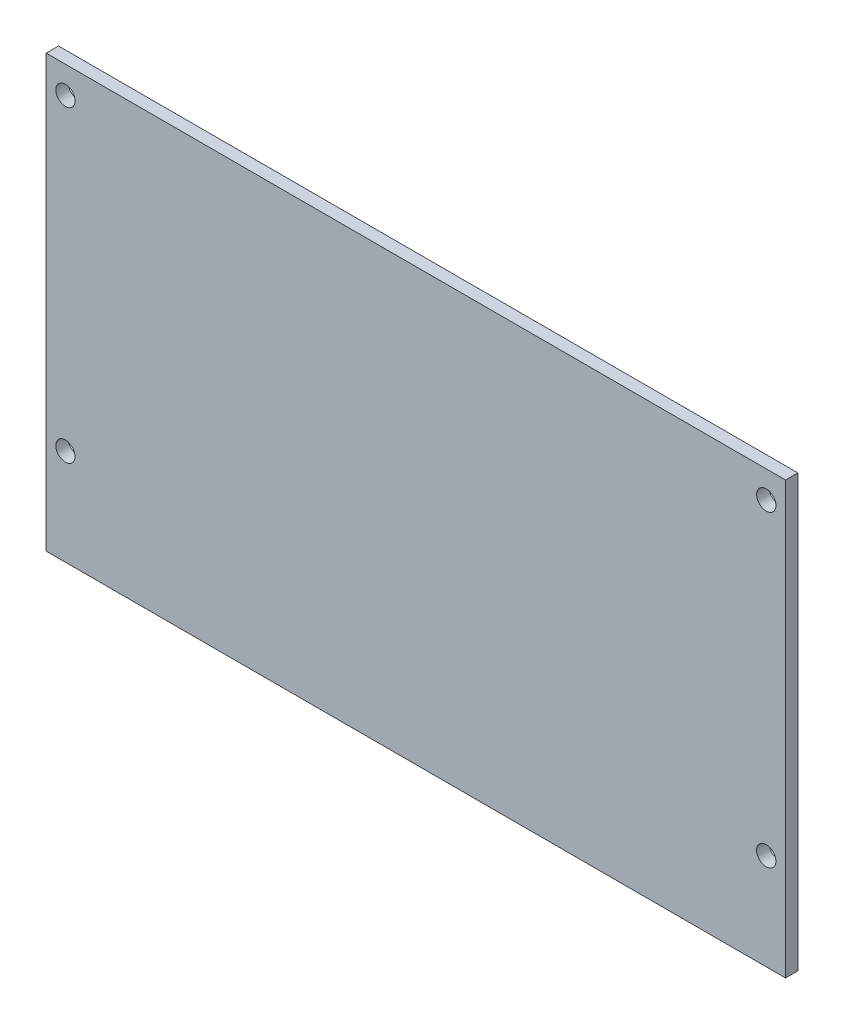
ISO-10303-21;
HEADER;
FILE_DESCRIPTION(('STEP AP214'),'2;1');
FILE_NAME('part.step','',(''),(''),'','','');
FILE_SCHEMA(('AUTOMOTIVE_DESIGN { 1 0 10303 214 1 1 1 1 }'));
ENDSEC;
DATA;
#1=APPLICATION_CONTEXT('core data for automotive mechanical design processes');
#2=APPLICATION_PROTOCOL_DEFINITION('international standard','automotive_design',2000,#1);
#3=PRODUCT_CONTEXT('',#1,'mechanical');
#4=PRODUCT('Part','Part','',(#3));
#5=PRODUCT_RELATED_PRODUCT_CATEGORY('part','',(#4));
#6=PRODUCT_DEFINITION_FORMATION('','',#4);
#7=PRODUCT_DEFINITION_CONTEXT('part definition',#1,'design');
#8=PRODUCT_DEFINITION('design','',#6,#7);
#9=PRODUCT_DEFINITION_SHAPE('','',#8);
#10=(LENGTH_UNIT() NAMED_UNIT(*) SI_UNIT(.MILLI.,.METRE.));
#11=(NAMED_UNIT(*) PLANE_ANGLE_UNIT() SI_UNIT($,.RADIAN.));
#12=(NAMED_UNIT(*) SI_UNIT($,.STERADIAN.) SOLID_ANGLE_UNIT());
#13=UNCERTAINTY_MEASURE_WITH_UNIT(LENGTH_MEASURE(1.E-05),#10,'distance_accuracy_value','');
#14=(GEOMETRIC_REPRESENTATION_CONTEXT(3) GLOBAL_UNCERTAINTY_ASSIGNED_CONTEXT((#13)) GLOBAL_UNIT_ASSIGNED_CONTEXT((#10,
#11,#12)) REPRESENTATION_CONTEXT('',''));
#15=CARTESIAN_POINT('',(0.,0.,0.));
#16=DIRECTION('',(0.,0.,1.));
#17=DIRECTION('',(1.,0.,0.));
#18=AXIS2_PLACEMENT_3D('',#15,#16,#17);
#19=CARTESIAN_POINT('',(-48.,-28.,1.6));
#20=DIRECTION('',(0.,0.,-1.));
#21=DIRECTION('',(-1.,0.,0.));
#22=AXIS2_PLACEMENT_3D('',#19,#20,#21);
#23=PLANE('',#22);
#24=CARTESIAN_POINT('',(45.5,-15.5,1.6));
#25=DIRECTION('',(0.,0.,1.));
#26=DIRECTION('',(-1.,0.,0.));
#27=AXIS2_PLACEMENT_3D('',#24,#25,#26);
#28=CIRCLE('',#27,1.25);
#29=CARTESIAN_POINT('',(44.25,-15.5,1.6));
#30=VERTEX_POINT('',#29);
#31=EDGE_CURVE('E120',#30,#30,#28,.T.);
#32=ORIENTED_EDGE('',*,*,#31,.F.);
#33=EDGE_LOOP('',(#32));
#34=FACE_BOUND('',#33,.T.);
#35=CARTESIAN_POINT('',(-45.5,24.5,1.6));
#36=DIRECTION('',(0.,0.,1.));
#37=DIRECTION('',(1.,0.,0.));
#38=AXIS2_PLACEMENT_3D('',#35,#36,#37);
#39=CIRCLE('',#38,1.25);
#40=CARTESIAN_POINT('',(-44.25,24.5,1.6));
#41=VERTEX_POINT('',#40);
#42=EDGE_CURVE('E99',#41,#41,#39,.T.);
#43=ORIENTED_EDGE('',*,*,#42,.F.);
#44=EDGE_LOOP('',(#43));
#45=FACE_BOUND('',#44,.T.);
#46=DIRECTION('',(0.,-1.,0.));
#47=VECTOR('',#46,1.);
#48=CARTESIAN_POINT('',(-48.,28.,1.6));
#49=LINE('',#48,#47);
#50=CARTESIAN_POINT('',(-48.,28.,1.6));
#51=VERTEX_POINT('',#50);
#52=CARTESIAN_POINT('',(-48.,-28.,1.6));
#53=VERTEX_POINT('',#52);
#54=EDGE_CURVE('E84',#51,#53,#49,.T.);
#55=ORIENTED_EDGE('',*,*,#54,.T.);
#56=DIRECTION('',(1.,0.,0.));
#57=VECTOR('',#56,1.);
#58=CARTESIAN_POINT('',(48.,-28.,1.6));
#59=LINE('',#58,#57);
#60=CARTESIAN_POINT('',(48.,-28.,1.6));
#61=VERTEX_POINT('',#60);
#62=EDGE_CURVE('E79',#53,#61,#59,.T.);
#63=ORIENTED_EDGE('',*,*,#62,.T.);
#64=DIRECTION('',(0.,1.,0.));
#65=VECTOR('',#64,1.);
#66=CARTESIAN_POINT('',(48.,28.,1.6));
#67=LINE('',#66,#65);
#68=CARTESIAN_POINT('',(48.,28.,1.6));
#69=VERTEX_POINT('',#68);
#70=EDGE_CURVE('E82',#61,#69,#67,.T.);
#71=ORIENTED_EDGE('',*,*,#70,.T.);
#72=DIRECTION('',(-1.,0.,0.));
#73=VECTOR('',#72,1.);
#74=CARTESIAN_POINT('',(48.,28.,1.6));
#75=LINE('',#74,#73);
#76=EDGE_CURVE('E49',#69,#51,#75,.T.);
#77=ORIENTED_EDGE('',*,*,#76,.T.);
#78=EDGE_LOOP('',(#55,#63,#71,#77));
#79=FACE_BOUND('',#78,.T.);
#80=CARTESIAN_POINT('',(-45.5,-15.5,1.6));
#81=DIRECTION('',(0.,0.,1.));
#82=DIRECTION('',(1.,0.,0.));
#83=AXIS2_PLACEMENT_3D('',#80,#81,#82);
#84=CIRCLE('',#83,1.25);
#85=CARTESIAN_POINT('',(-44.25,-15.5,1.6));
#86=VERTEX_POINT('',#85);
#87=EDGE_CURVE('E114',#86,#86,#84,.T.);
#88=ORIENTED_EDGE('',*,*,#87,.F.);
#89=EDGE_LOOP('',(#88));
#90=FACE_BOUND('',#89,.T.);
#91=CARTESIAN_POINT('',(45.5,24.5,1.6));
#92=DIRECTION('',(0.,0.,1.));
#93=DIRECTION('',(-1.,0.,0.));
#94=AXIS2_PLACEMENT_3D('',#91,#92,#93);
#95=CIRCLE('',#94,1.25);
#96=CARTESIAN_POINT('',(44.25,24.5,1.6));
#97=VERTEX_POINT('',#96);
#98=EDGE_CURVE('E126',#97,#97,#95,.T.);
#99=ORIENTED_EDGE('',*,*,#98,.F.);
#100=EDGE_LOOP('',(#99));
#101=FACE_BOUND('',#100,.T.);
#102=ADVANCED_FACE('F32',(#34,#45,#79,#90,#101),#23,.F.);
#103=CARTESIAN_POINT('',(-48.,-28.,0.));
#104=DIRECTION('',(0.,0.,-1.));
#105=DIRECTION('',(-1.,0.,0.));
#106=AXIS2_PLACEMENT_3D('',#103,#104,#105);
#107=PLANE('',#106);
#108=CARTESIAN_POINT('',(45.5,-15.5,0.));
#109=DIRECTION('',(0.,0.,1.));
#110=DIRECTION('',(-1.,0.,0.));
#111=AXIS2_PLACEMENT_3D('',#108,#109,#110);
#112=CIRCLE('',#111,1.25);
#113=CARTESIAN_POINT('',(44.25,-15.5,0.));
#114=VERTEX_POINT('',#113);
#115=EDGE_CURVE('E123',#114,#114,#112,.T.);
#116=ORIENTED_EDGE('',*,*,#115,.T.);
#117=EDGE_LOOP('',(#116));
#118=FACE_BOUND('',#117,.T.);
#119=CARTESIAN_POINT('',(-45.5,24.5,0.));
#120=DIRECTION('',(0.,0.,1.));
#121=DIRECTION('',(1.,0.,0.));
#122=AXIS2_PLACEMENT_3D('',#119,#120,#121);
#123=CIRCLE('',#122,1.25);
#124=CARTESIAN_POINT('',(-44.25,24.5,0.));
#125=VERTEX_POINT('',#124);
#126=EDGE_CURVE('E111',#125,#125,#123,.T.);
#127=ORIENTED_EDGE('',*,*,#126,.T.);
#128=EDGE_LOOP('',(#127));
#129=FACE_BOUND('',#128,.T.);
#130=DIRECTION('',(0.,-1.,0.));
#131=VECTOR('',#130,1.);
#132=CARTESIAN_POINT('',(-48.,28.,0.));
#133=LINE('',#132,#131);
#134=CARTESIAN_POINT('',(-48.,28.,0.));
#135=VERTEX_POINT('',#134);
#136=CARTESIAN_POINT('',(-48.,-28.,0.));
#137=VERTEX_POINT('',#136);
#138=EDGE_CURVE('E96',#135,#137,#133,.T.);
#139=ORIENTED_EDGE('',*,*,#138,.F.);
#140=DIRECTION('',(-1.,0.,0.));
#141=VECTOR('',#140,1.);
#142=CARTESIAN_POINT('',(48.,28.,0.));
#143=LINE('',#142,#141);
#144=CARTESIAN_POINT('',(48.,28.,0.));
#145=VERTEX_POINT('',#144);
#146=EDGE_CURVE('E72',#145,#135,#143,.T.);
#147=ORIENTED_EDGE('',*,*,#146,.F.);
#148=DIRECTION('',(0.,1.,0.));
#149=VECTOR('',#148,1.);
#150=CARTESIAN_POINT('',(48.,28.,0.));
#151=LINE('',#150,#149);
#152=CARTESIAN_POINT('',(48.,-28.,0.));
#153=VERTEX_POINT('',#152);
#154=EDGE_CURVE('E66',#153,#145,#151,.T.);
#155=ORIENTED_EDGE('',*,*,#154,.F.);
#156=DIRECTION('',(1.,0.,0.));
#157=VECTOR('',#156,1.);
#158=CARTESIAN_POINT('',(48.,-28.,0.));
#159=LINE('',#158,#157);
#160=EDGE_CURVE('E88',#137,#153,#159,.T.);
#161=ORIENTED_EDGE('',*,*,#160,.F.);
#162=EDGE_LOOP('',(#139,#147,#155,#161));
#163=FACE_BOUND('',#162,.T.);
#164=CARTESIAN_POINT('',(-45.5,-15.5,0.));
#165=DIRECTION('',(0.,0.,1.));
#166=DIRECTION('',(1.,0.,0.));
#167=AXIS2_PLACEMENT_3D('',#164,#165,#166);
#168=CIRCLE('',#167,1.25);
#169=CARTESIAN_POINT('',(-44.25,-15.5,0.));
#170=VERTEX_POINT('',#169);
#171=EDGE_CURVE('E117',#170,#170,#168,.T.);
#172=ORIENTED_EDGE('',*,*,#171,.T.);
#173=EDGE_LOOP('',(#172));
#174=FACE_BOUND('',#173,.T.);
#175=CARTESIAN_POINT('',(45.5,24.5,0.));
#176=DIRECTION('',(0.,0.,1.));
#177=DIRECTION('',(-1.,0.,0.));
#178=AXIS2_PLACEMENT_3D('',#175,#176,#177);
#179=CIRCLE('',#178,1.25);
#180=CARTESIAN_POINT('',(44.25,24.5,0.));
#181=VERTEX_POINT('',#180);
#182=EDGE_CURVE('E129',#181,#181,#179,.T.);
#183=ORIENTED_EDGE('',*,*,#182,.T.);
#184=EDGE_LOOP('',(#183));
#185=FACE_BOUND('',#184,.T.);
#186=ADVANCED_FACE('F107',(#118,#129,#163,#174,#185),#107,.T.);
#187=CARTESIAN_POINT('',(-48.,28.,1.6));
#188=DIRECTION('',(1.,0.,0.));
#189=DIRECTION('',(0.,1.,0.));
#190=AXIS2_PLACEMENT_3D('',#187,#188,#189);
#191=PLANE('',#190);
#192=ORIENTED_EDGE('',*,*,#138,.T.);
#193=DIRECTION('',(0.,0.,-1.));
#194=VECTOR('',#193,1.);
#195=CARTESIAN_POINT('',(-48.,-28.,1.6));
#196=LINE('',#195,#194);
#197=EDGE_CURVE('E11',#53,#137,#196,.T.);
#198=ORIENTED_EDGE('',*,*,#197,.F.);
#199=ORIENTED_EDGE('',*,*,#54,.F.);
#200=DIRECTION('',(0.,0.,-1.));
#201=VECTOR('',#200,1.);
#202=CARTESIAN_POINT('',(-48.,28.,1.6));
#203=LINE('',#202,#201);
#204=EDGE_CURVE('E92',#51,#135,#203,.T.);
#205=ORIENTED_EDGE('',*,*,#204,.T.);
#206=EDGE_LOOP('',(#192,#198,#199,#205));
#207=FACE_BOUND('',#206,.T.);
#208=ADVANCED_FACE('F34',(#207),#191,.F.);
#209=CARTESIAN_POINT('',(48.,-28.,1.6));
#210=DIRECTION('',(0.,1.,0.));
#211=DIRECTION('',(-1.,0.,0.));
#212=AXIS2_PLACEMENT_3D('',#209,#210,#211);
#213=PLANE('',#212);
#214=ORIENTED_EDGE('',*,*,#160,.T.);
#215=DIRECTION('',(0.,0.,-1.));
#216=VECTOR('',#215,1.);
#217=CARTESIAN_POINT('',(48.,-28.,1.6));
#218=LINE('',#217,#216);
#219=EDGE_CURVE('E41',#61,#153,#218,.T.);
#220=ORIENTED_EDGE('',*,*,#219,.F.);
#221=ORIENTED_EDGE('',*,*,#62,.F.);
#222=ORIENTED_EDGE('',*,*,#197,.T.);
#223=EDGE_LOOP('',(#214,#220,#221,#222));
#224=FACE_BOUND('',#223,.T.);
#225=ADVANCED_FACE('F87',(#224),#213,.F.);
#226=CARTESIAN_POINT('',(48.,28.,1.6));
#227=DIRECTION('',(-1.,0.,0.));
#228=DIRECTION('',(0.,-1.,0.));
#229=AXIS2_PLACEMENT_3D('',#226,#227,#228);
#230=PLANE('',#229);
#231=ORIENTED_EDGE('',*,*,#154,.T.);
#232=DIRECTION('',(0.,0.,-1.));
#233=VECTOR('',#232,1.);
#234=CARTESIAN_POINT('',(48.,28.,1.6));
#235=LINE('',#234,#233);
#236=EDGE_CURVE('E89',#69,#145,#235,.T.);
#237=ORIENTED_EDGE('',*,*,#236,.F.);
#238=ORIENTED_EDGE('',*,*,#70,.F.);
#239=ORIENTED_EDGE('',*,*,#219,.T.);
#240=EDGE_LOOP('',(#231,#237,#238,#239));
#241=FACE_BOUND('',#240,.T.);
#242=ADVANCED_FACE('F90',(#241),#230,.F.);
#243=CARTESIAN_POINT('',(48.,28.,1.6));
#244=DIRECTION('',(0.,-1.,0.));
#245=DIRECTION('',(1.,0.,0.));
#246=AXIS2_PLACEMENT_3D('',#243,#244,#245);
#247=PLANE('',#246);
#248=ORIENTED_EDGE('',*,*,#146,.T.);
#249=ORIENTED_EDGE('',*,*,#204,.F.);
#250=ORIENTED_EDGE('',*,*,#76,.F.);
#251=ORIENTED_EDGE('',*,*,#236,.T.);
#252=EDGE_LOOP('',(#248,#249,#250,#251));
#253=FACE_BOUND('',#252,.T.);
#254=ADVANCED_FACE('F104',(#253),#247,.F.);
#255=CARTESIAN_POINT('',(-45.5,24.5,1.6));
#256=DIRECTION('',(0.,0.,-1.));
#257=DIRECTION('',(-1.,0.,0.));
#258=AXIS2_PLACEMENT_3D('',#255,#256,#257);
#259=CYLINDRICAL_SURFACE('',#258,1.25);
#260=ORIENTED_EDGE('',*,*,#42,.T.);
#261=EDGE_LOOP('',(#260));
#262=FACE_BOUND('',#261,.T.);
#263=ORIENTED_EDGE('',*,*,#126,.F.);
#264=EDGE_LOOP('',(#263));
#265=FACE_BOUND('',#264,.T.);
#266=ADVANCED_FACE('F149',(#262,#265),#259,.F.);
#267=CARTESIAN_POINT('',(-45.5,-15.5,1.6));
#268=DIRECTION('',(0.,0.,-1.));
#269=DIRECTION('',(-1.,0.,0.));
#270=AXIS2_PLACEMENT_3D('',#267,#268,#269);
#271=CYLINDRICAL_SURFACE('',#270,1.25);
#272=ORIENTED_EDGE('',*,*,#87,.T.);
#273=EDGE_LOOP('',(#272));
#274=FACE_BOUND('',#273,.T.);
#275=ORIENTED_EDGE('',*,*,#171,.F.);
#276=EDGE_LOOP('',(#275));
#277=FACE_BOUND('',#276,.T.);
#278=ADVANCED_FACE('F195',(#274,#277),#271,.F.);
#279=CARTESIAN_POINT('',(45.5,-15.5,1.6));
#280=DIRECTION('',(0.,0.,-1.));
#281=DIRECTION('',(-1.,0.,0.));
#282=AXIS2_PLACEMENT_3D('',#279,#280,#281);
#283=CYLINDRICAL_SURFACE('',#282,1.25);
#284=ORIENTED_EDGE('',*,*,#31,.T.);
#285=EDGE_LOOP('',(#284));
#286=FACE_BOUND('',#285,.T.);
#287=ORIENTED_EDGE('',*,*,#115,.F.);
#288=EDGE_LOOP('',(#287));
#289=FACE_BOUND('',#288,.T.);
#290=ADVANCED_FACE('F203',(#286,#289),#283,.F.);
#291=CARTESIAN_POINT('',(45.5,24.5,1.6));
#292=DIRECTION('',(0.,0.,-1.));
#293=DIRECTION('',(-1.,0.,0.));
#294=AXIS2_PLACEMENT_3D('',#291,#292,#293);
#295=CYLINDRICAL_SURFACE('',#294,1.25);
#296=ORIENTED_EDGE('',*,*,#98,.T.);
#297=EDGE_LOOP('',(#296));
#298=FACE_BOUND('',#297,.T.);
#299=ORIENTED_EDGE('',*,*,#182,.F.);
#300=EDGE_LOOP('',(#299));
#301=FACE_BOUND('',#300,.T.);
#302=ADVANCED_FACE('F135',(#298,#301),#295,.F.);
#303=CLOSED_SHELL('',(#102,#186,#208,#225,#242,#254,#266,#278,#290,#302));
#304=MANIFOLD_SOLID_BREP('B2',#303);
#305=ADVANCED_BREP_SHAPE_REPRESENTATION('',(#18,#304),#14);
#306=SHAPE_DEFINITION_REPRESENTATION(#9,#305);
ENDSEC;
END-ISO-10303-21;
